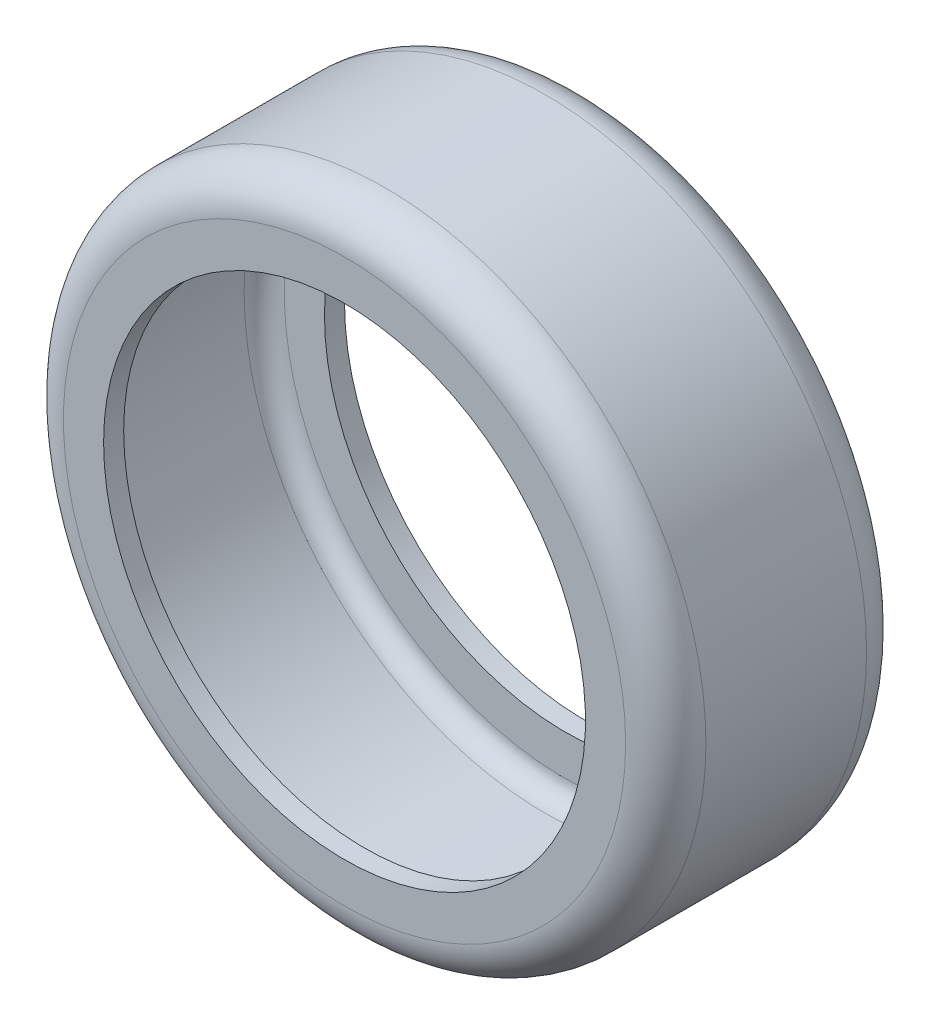
ISO-10303-21;
HEADER;
FILE_DESCRIPTION(('STEP AP214'),'2;1');
FILE_NAME('part.step','',(''),(''),'','','');
FILE_SCHEMA(('AUTOMOTIVE_DESIGN { 1 0 10303 214 1 1 1 1 }'));
ENDSEC;
DATA;
#1=APPLICATION_CONTEXT('core data for automotive mechanical design processes');
#2=APPLICATION_PROTOCOL_DEFINITION('international standard','automotive_design',2000,#1);
#3=PRODUCT_CONTEXT('',#1,'mechanical');
#4=PRODUCT('Part','Part','',(#3));
#5=PRODUCT_RELATED_PRODUCT_CATEGORY('part','',(#4));
#6=PRODUCT_DEFINITION_FORMATION('','',#4);
#7=PRODUCT_DEFINITION_CONTEXT('part definition',#1,'design');
#8=PRODUCT_DEFINITION('design','',#6,#7);
#9=PRODUCT_DEFINITION_SHAPE('','',#8);
#10=(LENGTH_UNIT() NAMED_UNIT(*) SI_UNIT(.MILLI.,.METRE.));
#11=(NAMED_UNIT(*) PLANE_ANGLE_UNIT() SI_UNIT($,.RADIAN.));
#12=(NAMED_UNIT(*) SI_UNIT($,.STERADIAN.) SOLID_ANGLE_UNIT());
#13=UNCERTAINTY_MEASURE_WITH_UNIT(LENGTH_MEASURE(1.E-05),#10,'distance_accuracy_value','');
#14=(GEOMETRIC_REPRESENTATION_CONTEXT(3) GLOBAL_UNCERTAINTY_ASSIGNED_CONTEXT((#13)) GLOBAL_UNIT_ASSIGNED_CONTEXT((#10,
#11,#12)) REPRESENTATION_CONTEXT('',''));
#15=CARTESIAN_POINT('',(0.,0.,0.));
#16=DIRECTION('',(0.,0.,1.));
#17=DIRECTION('',(1.,0.,0.));
#18=AXIS2_PLACEMENT_3D('',#15,#16,#17);
#19=CARTESIAN_POINT('',(0.,0.,38.1));
#20=DIRECTION('',(0.,0.,-1.));
#21=DIRECTION('',(-1.,0.,0.));
#22=AXIS2_PLACEMENT_3D('',#19,#20,#21);
#23=CYLINDRICAL_SURFACE('',#22,76.2);
#24=CARTESIAN_POINT('',(0.,0.,-38.1));
#25=DIRECTION('',(0.,0.,1.));
#26=DIRECTION('',(1.,0.,0.));
#27=AXIS2_PLACEMENT_3D('',#24,#25,#26);
#28=CIRCLE('',#27,76.2);
#29=CARTESIAN_POINT('',(-76.2,0.,-38.1));
#30=VERTEX_POINT('',#29);
#31=EDGE_CURVE('E68',#30,#30,#28,.T.);
#32=CARTESIAN_POINT('',(0.,0.,-31.75));
#33=DIRECTION('',(0.,0.,1.));
#34=DIRECTION('',(1.,0.,0.));
#35=AXIS2_PLACEMENT_3D('',#32,#33,#34);
#36=CIRCLE('',#35,76.2);
#37=CARTESIAN_POINT('',(-76.2,0.,-31.75));
#38=VERTEX_POINT('',#37);
#39=EDGE_CURVE('E76',#38,#38,#36,.T.);
#40=CARTESIAN_POINT('',(-76.2,0.,-38.1));
#41=CARTESIAN_POINT('',(-76.2,0.,-38.0338541666667));
#42=CARTESIAN_POINT('',(-76.2,0.,-37.9677083333333));
#43=CARTESIAN_POINT('',(-76.2,0.,-37.8354166666667));
#44=CARTESIAN_POINT('',(-76.2,0.,-37.7692708333333));
#45=CARTESIAN_POINT('',(-76.2,0.,-37.6369791666667));
#46=CARTESIAN_POINT('',(-76.2,0.,-37.5708333333333));
#47=CARTESIAN_POINT('',(-76.2,0.,-37.4385416666667));
#48=CARTESIAN_POINT('',(-76.2,0.,-37.3723958333333));
#49=CARTESIAN_POINT('',(-76.2,0.,-37.2401041666667));
#50=CARTESIAN_POINT('',(-76.2,0.,-37.1739583333333));
#51=CARTESIAN_POINT('',(-76.2,0.,-37.0416666666667));
#52=CARTESIAN_POINT('',(-76.2,0.,-36.9755208333333));
#53=CARTESIAN_POINT('',(-76.2,0.,-36.8432291666667));
#54=CARTESIAN_POINT('',(-76.2,0.,-36.7770833333333));
#55=CARTESIAN_POINT('',(-76.2,0.,-36.6447916666667));
#56=CARTESIAN_POINT('',(-76.2,0.,-36.5786458333333));
#57=CARTESIAN_POINT('',(-76.2,0.,-36.4463541666667));
#58=CARTESIAN_POINT('',(-76.2,0.,-36.3802083333333));
#59=CARTESIAN_POINT('',(-76.2,0.,-36.2479166666667));
#60=CARTESIAN_POINT('',(-76.2,0.,-36.1817708333333));
#61=CARTESIAN_POINT('',(-76.2,0.,-36.0494791666667));
#62=CARTESIAN_POINT('',(-76.2,0.,-35.9833333333333));
#63=CARTESIAN_POINT('',(-76.2,0.,-35.8510416666667));
#64=CARTESIAN_POINT('',(-76.2,0.,-35.7848958333333));
#65=CARTESIAN_POINT('',(-76.2,0.,-35.6526041666667));
#66=CARTESIAN_POINT('',(-76.2,0.,-35.5864583333333));
#67=CARTESIAN_POINT('',(-76.2,0.,-35.4541666666667));
#68=CARTESIAN_POINT('',(-76.2,0.,-35.3880208333333));
#69=CARTESIAN_POINT('',(-76.2,0.,-35.2557291666667));
#70=CARTESIAN_POINT('',(-76.2,0.,-35.1895833333333));
#71=CARTESIAN_POINT('',(-76.2,0.,-35.0572916666667));
#72=CARTESIAN_POINT('',(-76.2,0.,-34.9911458333333));
#73=CARTESIAN_POINT('',(-76.2,0.,-34.8588541666667));
#74=CARTESIAN_POINT('',(-76.2,0.,-34.7927083333333));
#75=CARTESIAN_POINT('',(-76.2,0.,-34.6604166666667));
#76=CARTESIAN_POINT('',(-76.2,0.,-34.5942708333333));
#77=CARTESIAN_POINT('',(-76.2,0.,-34.4619791666667));
#78=CARTESIAN_POINT('',(-76.2,0.,-34.3958333333333));
#79=CARTESIAN_POINT('',(-76.2,0.,-34.2635416666667));
#80=CARTESIAN_POINT('',(-76.2,0.,-34.1973958333333));
#81=CARTESIAN_POINT('',(-76.2,0.,-34.0651041666667));
#82=CARTESIAN_POINT('',(-76.2,0.,-33.9989583333333));
#83=CARTESIAN_POINT('',(-76.2,0.,-33.8666666666667));
#84=CARTESIAN_POINT('',(-76.2,0.,-33.8005208333333));
#85=CARTESIAN_POINT('',(-76.2,0.,-33.6682291666667));
#86=CARTESIAN_POINT('',(-76.2,0.,-33.6020833333333));
#87=CARTESIAN_POINT('',(-76.2,0.,-33.4697916666667));
#88=CARTESIAN_POINT('',(-76.2,0.,-33.4036458333333));
#89=CARTESIAN_POINT('',(-76.2,0.,-33.2713541666667));
#90=CARTESIAN_POINT('',(-76.2,0.,-33.2052083333333));
#91=CARTESIAN_POINT('',(-76.2,0.,-33.0729166666667));
#92=CARTESIAN_POINT('',(-76.2,0.,-33.0067708333333));
#93=CARTESIAN_POINT('',(-76.2,0.,-32.8744791666667));
#94=CARTESIAN_POINT('',(-76.2,0.,-32.8083333333333));
#95=CARTESIAN_POINT('',(-76.2,0.,-32.6760416666667));
#96=CARTESIAN_POINT('',(-76.2,0.,-32.6098958333333));
#97=CARTESIAN_POINT('',(-76.2,0.,-32.4776041666667));
#98=CARTESIAN_POINT('',(-76.2,0.,-32.4114583333333));
#99=CARTESIAN_POINT('',(-76.2,0.,-32.2791666666667));
#100=CARTESIAN_POINT('',(-76.2,0.,-32.2130208333333));
#101=CARTESIAN_POINT('',(-76.2,0.,-32.0807291666667));
#102=CARTESIAN_POINT('',(-76.2,0.,-32.0145833333333));
#103=CARTESIAN_POINT('',(-76.2,0.,-31.8822916666667));
#104=CARTESIAN_POINT('',(-76.2,0.,-31.8161458333333));
#105=CARTESIAN_POINT('',(-76.2,0.,-31.75));
#106=B_SPLINE_CURVE_WITH_KNOTS('',3,(#40,#41,#42,#43,#44,#45,#46,#47,#48,#49,#50,#51,#52,#53,
#54,#55,#56,#57,#58,#59,#60,#61,#62,#63,#64,#65,#66,#67,#68,#69,#70,#71,#72,#73,#74,#75,#76,#77,
#78,#79,#80,#81,#82,#83,#84,#85,#86,#87,#88,#89,#90,#91,#92,#93,#94,#95,#96,#97,#98,#99,#100,
#101,#102,#103,#104,#105),.UNSPECIFIED.,.F.,.F.,(4,2,2,2,2,2,2,2,2,2,2,2,2,2,2,2,2,2,2,2,2,2,2,
2,2,2,2,2,2,2,2,2,4),(0.,0.198437499999995,0.396875000000005,0.5953125,0.793749999999996,
0.992187500000005,1.190625,1.3890625,1.58749999999999,1.7859375,1.984375,2.18281249999999,
2.38125,2.5796875,2.77812499999999,2.9765625,3.175,3.37343749999999,3.571875,3.7703125,
3.96874999999999,4.1671875,4.365625,4.56406249999999,4.7625,4.9609375,5.15937499999999,
5.35781249999999,5.55625,5.75468749999999,5.95312499999999,6.1515625,6.34999999999999),.UNSPECIFIED.);
#107=EDGE_CURVE('BSEAM43',#30,#38,#106,.T.);
#108=ORIENTED_EDGE('',*,*,#31,.F.);
#109=ORIENTED_EDGE('',*,*,#39,.T.);
#110=ORIENTED_EDGE('',*,*,#107,.T.);
#111=ORIENTED_EDGE('',*,*,#107,.F.);
#112=EDGE_LOOP('',(#108,#110,#109,#111));
#113=FACE_BOUND('',#112,.T.);
#114=ADVANCED_FACE('F43',(#113),#23,.F.);
#115=CARTESIAN_POINT('',(0.,0.,38.1));
#116=DIRECTION('',(0.,0.,1.));
#117=DIRECTION('',(1.,0.,0.));
#118=AXIS2_PLACEMENT_3D('',#115,#116,#117);
#119=PLANE('',#118);
#120=CARTESIAN_POINT('',(0.,0.,38.1));
#121=DIRECTION('',(0.,0.,1.));
#122=DIRECTION('',(1.,0.,0.));
#123=AXIS2_PLACEMENT_3D('',#120,#121,#122);
#124=CIRCLE('',#123,88.9);
#125=CARTESIAN_POINT('',(88.9,0.,38.1));
#126=VERTEX_POINT('',#125);
#127=EDGE_CURVE('E10',#126,#126,#124,.T.);
#128=ORIENTED_EDGE('',*,*,#127,.T.);
#129=EDGE_LOOP('',(#128));
#130=FACE_BOUND('',#129,.T.);
#131=CARTESIAN_POINT('',(0.,0.,38.1));
#132=DIRECTION('',(0.,0.,1.));
#133=DIRECTION('',(1.,0.,0.));
#134=AXIS2_PLACEMENT_3D('',#131,#132,#133);
#135=CIRCLE('',#134,76.2);
#136=CARTESIAN_POINT('',(-76.2,0.,38.1));
#137=VERTEX_POINT('',#136);
#138=EDGE_CURVE('E67',#137,#137,#135,.T.);
#139=ORIENTED_EDGE('',*,*,#138,.F.);
#140=EDGE_LOOP('',(#139));
#141=FACE_BOUND('',#140,.T.);
#142=ADVANCED_FACE('F117',(#130,#141),#119,.T.);
#143=CARTESIAN_POINT('',(0.,0.,-38.1));
#144=DIRECTION('',(0.,0.,1.));
#145=DIRECTION('',(1.,0.,0.));
#146=AXIS2_PLACEMENT_3D('',#143,#144,#145);
#147=PLANE('',#146);
#148=CARTESIAN_POINT('',(0.,0.,-38.1));
#149=DIRECTION('',(0.,0.,1.));
#150=DIRECTION('',(1.,0.,0.));
#151=AXIS2_PLACEMENT_3D('',#148,#149,#150);
#152=CIRCLE('',#151,88.9);
#153=CARTESIAN_POINT('',(88.9,0.,-38.1));
#154=VERTEX_POINT('',#153);
#155=EDGE_CURVE('E51',#154,#154,#152,.F.);
#156=ORIENTED_EDGE('',*,*,#155,.T.);
#157=EDGE_LOOP('',(#156));
#158=FACE_BOUND('',#157,.T.);
#159=ORIENTED_EDGE('',*,*,#31,.T.);
#160=EDGE_LOOP('',(#159));
#161=FACE_BOUND('',#160,.T.);
#162=ADVANCED_FACE('F119',(#158,#161),#147,.F.);
#163=CARTESIAN_POINT('',(0.,0.,38.1));
#164=DIRECTION('',(0.,0.,-1.));
#165=DIRECTION('',(-1.,0.,0.));
#166=AXIS2_PLACEMENT_3D('',#163,#164,#165);
#167=CYLINDRICAL_SURFACE('',#166,101.6);
#168=CARTESIAN_POINT('',(0.,0.,-25.4));
#169=DIRECTION('',(0.,0.,1.));
#170=DIRECTION('',(1.,0.,0.));
#171=AXIS2_PLACEMENT_3D('',#168,#169,#170);
#172=CIRCLE('',#171,101.6);
#173=CARTESIAN_POINT('',(-101.6,0.,-25.4));
#174=VERTEX_POINT('',#173);
#175=EDGE_CURVE('E56',#174,#174,#172,.T.);
#176=CARTESIAN_POINT('',(0.,0.,25.4));
#177=DIRECTION('',(0.,0.,1.));
#178=DIRECTION('',(1.,0.,0.));
#179=AXIS2_PLACEMENT_3D('',#176,#177,#178);
#180=CIRCLE('',#179,101.6);
#181=CARTESIAN_POINT('',(-101.6,0.,25.4));
#182=VERTEX_POINT('',#181);
#183=EDGE_CURVE('E61',#182,#182,#180,.F.);
#184=CARTESIAN_POINT('',(-101.6,0.,-25.4));
#185=CARTESIAN_POINT('',(-101.6,0.,-24.8708333333333));
#186=CARTESIAN_POINT('',(-101.6,0.,-24.3416666666667));
#187=CARTESIAN_POINT('',(-101.6,0.,-23.2833333333334));
#188=CARTESIAN_POINT('',(-101.6,0.,-22.7541666666667));
#189=CARTESIAN_POINT('',(-101.6,0.,-21.6958333333333));
#190=CARTESIAN_POINT('',(-101.6,0.,-21.1666666666667));
#191=CARTESIAN_POINT('',(-101.6,0.,-20.1083333333333));
#192=CARTESIAN_POINT('',(-101.6,0.,-19.5791666666667));
#193=CARTESIAN_POINT('',(-101.6,0.,-18.5208333333333));
#194=CARTESIAN_POINT('',(-101.6,0.,-17.9916666666667));
#195=CARTESIAN_POINT('',(-101.6,0.,-16.9333333333334));
#196=CARTESIAN_POINT('',(-101.6,0.,-16.4041666666667));
#197=CARTESIAN_POINT('',(-101.6,0.,-15.3458333333333));
#198=CARTESIAN_POINT('',(-101.6,0.,-14.8166666666667));
#199=CARTESIAN_POINT('',(-101.6,0.,-13.7583333333334));
#200=CARTESIAN_POINT('',(-101.6,0.,-13.2291666666667));
#201=CARTESIAN_POINT('',(-101.6,0.,-12.1708333333333));
#202=CARTESIAN_POINT('',(-101.6,0.,-11.6416666666667));
#203=CARTESIAN_POINT('',(-101.6,0.,-10.5833333333333));
#204=CARTESIAN_POINT('',(-101.6,0.,-10.0541666666667));
#205=CARTESIAN_POINT('',(-101.6,0.,-8.99583333333335));
#206=CARTESIAN_POINT('',(-101.6,0.,-8.46666666666668));
#207=CARTESIAN_POINT('',(-101.6,0.,-7.40833333333335));
#208=CARTESIAN_POINT('',(-101.6,0.,-6.87916666666668));
#209=CARTESIAN_POINT('',(-101.6,0.,-5.82083333333334));
#210=CARTESIAN_POINT('',(-101.6,0.,-5.29166666666668));
#211=CARTESIAN_POINT('',(-101.6,0.,-4.23333333333334));
#212=CARTESIAN_POINT('',(-101.6,0.,-3.70416666666668));
#213=CARTESIAN_POINT('',(-101.6,0.,-2.64583333333334));
#214=CARTESIAN_POINT('',(-101.6,0.,-2.11666666666667));
#215=CARTESIAN_POINT('',(-101.6,0.,-1.05833333333334));
#216=CARTESIAN_POINT('',(-101.6,0.,-0.529166666666673));
#217=CARTESIAN_POINT('',(-101.6,0.,0.529166666666659));
#218=CARTESIAN_POINT('',(-101.6,0.,1.05833333333333));
#219=CARTESIAN_POINT('',(-101.6,0.,2.11666666666666));
#220=CARTESIAN_POINT('',(-101.6,0.,2.64583333333333));
#221=CARTESIAN_POINT('',(-101.6,0.,3.70416666666666));
#222=CARTESIAN_POINT('',(-101.6,0.,4.23333333333333));
#223=CARTESIAN_POINT('',(-101.6,0.,5.29166666666666));
#224=CARTESIAN_POINT('',(-101.6,0.,5.82083333333333));
#225=CARTESIAN_POINT('',(-101.6,0.,6.87916666666666));
#226=CARTESIAN_POINT('',(-101.6,0.,7.40833333333333));
#227=CARTESIAN_POINT('',(-101.6,0.,8.46666666666666));
#228=CARTESIAN_POINT('',(-101.6,0.,8.99583333333333));
#229=CARTESIAN_POINT('',(-101.6,0.,10.0541666666667));
#230=CARTESIAN_POINT('',(-101.6,0.,10.5833333333333));
#231=CARTESIAN_POINT('',(-101.6,0.,11.6416666666667));
#232=CARTESIAN_POINT('',(-101.6,0.,12.1708333333333));
#233=CARTESIAN_POINT('',(-101.6,0.,13.2291666666667));
#234=CARTESIAN_POINT('',(-101.6,0.,13.7583333333333));
#235=CARTESIAN_POINT('',(-101.6,0.,14.8166666666667));
#236=CARTESIAN_POINT('',(-101.6,0.,15.3458333333333));
#237=CARTESIAN_POINT('',(-101.6,0.,16.4041666666667));
#238=CARTESIAN_POINT('',(-101.6,0.,16.9333333333333));
#239=CARTESIAN_POINT('',(-101.6,0.,17.9916666666667));
#240=CARTESIAN_POINT('',(-101.6,0.,18.5208333333333));
#241=CARTESIAN_POINT('',(-101.6,0.,19.5791666666667));
#242=CARTESIAN_POINT('',(-101.6,0.,20.1083333333333));
#243=CARTESIAN_POINT('',(-101.6,0.,21.1666666666667));
#244=CARTESIAN_POINT('',(-101.6,0.,21.6958333333333));
#245=CARTESIAN_POINT('',(-101.6,0.,22.7541666666667));
#246=CARTESIAN_POINT('',(-101.6,0.,23.2833333333333));
#247=CARTESIAN_POINT('',(-101.6,0.,24.3416666666667));
#248=CARTESIAN_POINT('',(-101.6,0.,24.8708333333333));
#249=CARTESIAN_POINT('',(-101.6,0.,25.4));
#250=B_SPLINE_CURVE_WITH_KNOTS('',3,(#184,#185,#186,#187,#188,#189,#190,#191,#192,#193,#194,
#195,#196,#197,#198,#199,#200,#201,#202,#203,#204,#205,#206,#207,#208,#209,#210,#211,#212,#213,
#214,#215,#216,#217,#218,#219,#220,#221,#222,#223,#224,#225,#226,#227,#228,#229,#230,#231,#232,
#233,#234,#235,#236,#237,#238,#239,#240,#241,#242,#243,#244,#245,#246,#247,#248,#249),
.UNSPECIFIED.,.F.,.F.,(4,2,2,2,2,2,2,2,2,2,2,2,2,2,2,2,2,2,2,2,2,2,2,2,2,2,2,2,2,2,2,2,4),(0.,
1.58749999999999,3.175,4.7625,6.34999999999999,7.93749999999999,9.525,11.1125,12.7,14.2875,
15.875,17.4625,19.05,20.6375,22.225,23.8125,25.4,26.9875,28.575,30.1625,31.75,33.3375,34.925,
36.5125,38.1,39.6875,41.275,42.8625,44.45,46.0375,47.625,49.2125,50.8),.UNSPECIFIED.);
#251=EDGE_CURVE('BSEAM113',#174,#182,#250,.T.);
#252=ORIENTED_EDGE('',*,*,#175,.T.);
#253=ORIENTED_EDGE('',*,*,#183,.T.);
#254=ORIENTED_EDGE('',*,*,#251,.T.);
#255=ORIENTED_EDGE('',*,*,#251,.F.);
#256=EDGE_LOOP('',(#252,#254,#253,#255));
#257=FACE_BOUND('',#256,.T.);
#258=ADVANCED_FACE('F113',(#257),#167,.T.);
#259=CARTESIAN_POINT('',(0.,0.,31.75));
#260=DIRECTION('',(0.,0.,1.));
#261=DIRECTION('',(1.,0.,0.));
#262=AXIS2_PLACEMENT_3D('',#259,#260,#261);
#263=CIRCLE('',#262,76.2);
#264=CARTESIAN_POINT('',(-76.2,0.,31.75));
#265=VERTEX_POINT('',#264);
#266=EDGE_CURVE('E80',#265,#265,#263,.T.);
#267=CARTESIAN_POINT('',(-76.2,0.,31.75));
#268=CARTESIAN_POINT('',(-76.2,0.,31.8161458333333));
#269=CARTESIAN_POINT('',(-76.2,0.,31.8822916666667));
#270=CARTESIAN_POINT('',(-76.2,0.,32.0145833333333));
#271=CARTESIAN_POINT('',(-76.2,0.,32.0807291666667));
#272=CARTESIAN_POINT('',(-76.2,0.,32.2130208333333));
#273=CARTESIAN_POINT('',(-76.2,0.,32.2791666666667));
#274=CARTESIAN_POINT('',(-76.2,0.,32.4114583333333));
#275=CARTESIAN_POINT('',(-76.2,0.,32.4776041666667));
#276=CARTESIAN_POINT('',(-76.2,0.,32.6098958333333));
#277=CARTESIAN_POINT('',(-76.2,0.,32.6760416666667));
#278=CARTESIAN_POINT('',(-76.2,0.,32.8083333333333));
#279=CARTESIAN_POINT('',(-76.2,0.,32.8744791666667));
#280=CARTESIAN_POINT('',(-76.2,0.,33.0067708333333));
#281=CARTESIAN_POINT('',(-76.2,0.,33.0729166666667));
#282=CARTESIAN_POINT('',(-76.2,0.,33.2052083333333));
#283=CARTESIAN_POINT('',(-76.2,0.,33.2713541666667));
#284=CARTESIAN_POINT('',(-76.2,0.,33.4036458333333));
#285=CARTESIAN_POINT('',(-76.2,0.,33.4697916666667));
#286=CARTESIAN_POINT('',(-76.2,0.,33.6020833333333));
#287=CARTESIAN_POINT('',(-76.2,0.,33.6682291666667));
#288=CARTESIAN_POINT('',(-76.2,0.,33.8005208333333));
#289=CARTESIAN_POINT('',(-76.2,0.,33.8666666666667));
#290=CARTESIAN_POINT('',(-76.2,0.,33.9989583333333));
#291=CARTESIAN_POINT('',(-76.2,0.,34.0651041666667));
#292=CARTESIAN_POINT('',(-76.2,0.,34.1973958333333));
#293=CARTESIAN_POINT('',(-76.2,0.,34.2635416666667));
#294=CARTESIAN_POINT('',(-76.2,0.,34.3958333333333));
#295=CARTESIAN_POINT('',(-76.2,0.,34.4619791666667));
#296=CARTESIAN_POINT('',(-76.2,0.,34.5942708333333));
#297=CARTESIAN_POINT('',(-76.2,0.,34.6604166666667));
#298=CARTESIAN_POINT('',(-76.2,0.,34.7927083333333));
#299=CARTESIAN_POINT('',(-76.2,0.,34.8588541666667));
#300=CARTESIAN_POINT('',(-76.2,0.,34.9911458333333));
#301=CARTESIAN_POINT('',(-76.2,0.,35.0572916666667));
#302=CARTESIAN_POINT('',(-76.2,0.,35.1895833333333));
#303=CARTESIAN_POINT('',(-76.2,0.,35.2557291666667));
#304=CARTESIAN_POINT('',(-76.2,0.,35.3880208333333));
#305=CARTESIAN_POINT('',(-76.2,0.,35.4541666666667));
#306=CARTESIAN_POINT('',(-76.2,0.,35.5864583333333));
#307=CARTESIAN_POINT('',(-76.2,0.,35.6526041666667));
#308=CARTESIAN_POINT('',(-76.2,0.,35.7848958333333));
#309=CARTESIAN_POINT('',(-76.2,0.,35.8510416666667));
#310=CARTESIAN_POINT('',(-76.2,0.,35.9833333333333));
#311=CARTESIAN_POINT('',(-76.2,0.,36.0494791666667));
#312=CARTESIAN_POINT('',(-76.2,0.,36.1817708333333));
#313=CARTESIAN_POINT('',(-76.2,0.,36.2479166666667));
#314=CARTESIAN_POINT('',(-76.2,0.,36.3802083333333));
#315=CARTESIAN_POINT('',(-76.2,0.,36.4463541666667));
#316=CARTESIAN_POINT('',(-76.2,0.,36.5786458333333));
#317=CARTESIAN_POINT('',(-76.2,0.,36.6447916666667));
#318=CARTESIAN_POINT('',(-76.2,0.,36.7770833333333));
#319=CARTESIAN_POINT('',(-76.2,0.,36.8432291666667));
#320=CARTESIAN_POINT('',(-76.2,0.,36.9755208333333));
#321=CARTESIAN_POINT('',(-76.2,0.,37.0416666666667));
#322=CARTESIAN_POINT('',(-76.2,0.,37.1739583333333));
#323=CARTESIAN_POINT('',(-76.2,0.,37.2401041666667));
#324=CARTESIAN_POINT('',(-76.2,0.,37.3723958333333));
#325=CARTESIAN_POINT('',(-76.2,0.,37.4385416666667));
#326=CARTESIAN_POINT('',(-76.2,0.,37.5708333333333));
#327=CARTESIAN_POINT('',(-76.2,0.,37.6369791666667));
#328=CARTESIAN_POINT('',(-76.2,0.,37.7692708333333));
#329=CARTESIAN_POINT('',(-76.2,0.,37.8354166666667));
#330=CARTESIAN_POINT('',(-76.2,0.,37.9677083333333));
#331=CARTESIAN_POINT('',(-76.2,0.,38.0338541666667));
#332=CARTESIAN_POINT('',(-76.2,0.,38.1));
#333=B_SPLINE_CURVE_WITH_KNOTS('',3,(#267,#268,#269,#270,#271,#272,#273,#274,#275,#276,#277,
#278,#279,#280,#281,#282,#283,#284,#285,#286,#287,#288,#289,#290,#291,#292,#293,#294,#295,#296,
#297,#298,#299,#300,#301,#302,#303,#304,#305,#306,#307,#308,#309,#310,#311,#312,#313,#314,#315,
#316,#317,#318,#319,#320,#321,#322,#323,#324,#325,#326,#327,#328,#329,#330,#331,#332),
.UNSPECIFIED.,.F.,.F.,(4,2,2,2,2,2,2,2,2,2,2,2,2,2,2,2,2,2,2,2,2,2,2,2,2,2,2,2,2,2,2,2,4),(0.,
0.198437500000002,0.396875000000005,0.5953125,0.793750000000003,0.992187500000005,1.190625,
1.3890625,1.58750000000001,1.7859375,1.984375,2.18281250000001,2.38125,2.5796875,
2.77812500000001,2.9765625,3.175,3.37343750000001,3.571875,3.7703125,3.96875000000001,4.1671875,
4.365625,4.56406250000001,4.7625,4.96093750000001,5.15937500000001,5.3578125,5.55625000000001,
5.75468750000001,5.953125,6.15156250000001,6.35000000000001),.UNSPECIFIED.);
#334=EDGE_CURVE('BSEAM109',#265,#137,#333,.T.);
#335=ORIENTED_EDGE('',*,*,#266,.F.);
#336=ORIENTED_EDGE('',*,*,#138,.T.);
#337=ORIENTED_EDGE('',*,*,#334,.T.);
#338=ORIENTED_EDGE('',*,*,#334,.F.);
#339=EDGE_LOOP('',(#335,#337,#336,#338));
#340=FACE_BOUND('',#339,.T.);
#341=ADVANCED_FACE('F109',(#340),#23,.F.);
#342=CARTESIAN_POINT('',(0.,0.,-25.4));
#343=DIRECTION('',(0.,0.,1.));
#344=DIRECTION('',(1.,0.,0.));
#345=AXIS2_PLACEMENT_3D('',#342,#343,#344);
#346=TOROIDAL_SURFACE('',#345,88.9,12.7);
#347=ORIENTED_EDGE('',*,*,#155,.F.);
#348=EDGE_LOOP('',(#347));
#349=FACE_BOUND('',#348,.T.);
#350=ORIENTED_EDGE('',*,*,#175,.F.);
#351=EDGE_LOOP('',(#350));
#352=FACE_BOUND('',#351,.T.);
#353=ADVANCED_FACE('F112',(#349,#352),#346,.T.);
#354=CARTESIAN_POINT('',(0.,0.,25.4));
#355=DIRECTION('',(0.,0.,1.));
#356=DIRECTION('',(1.,0.,0.));
#357=AXIS2_PLACEMENT_3D('',#354,#355,#356);
#358=TOROIDAL_SURFACE('',#357,88.9,12.7);
#359=ORIENTED_EDGE('',*,*,#183,.F.);
#360=EDGE_LOOP('',(#359));
#361=FACE_BOUND('',#360,.T.);
#362=ORIENTED_EDGE('',*,*,#127,.F.);
#363=EDGE_LOOP('',(#362));
#364=FACE_BOUND('',#363,.T.);
#365=ADVANCED_FACE('F45',(#361,#364),#358,.T.);
#366=CARTESIAN_POINT('',(0.,0.,31.75));
#367=DIRECTION('',(0.,0.,1.));
#368=DIRECTION('',(1.,0.,0.));
#369=AXIS2_PLACEMENT_3D('',#366,#367,#368);
#370=PLANE('',#369);
#371=CARTESIAN_POINT('',(0.,0.,31.75));
#372=DIRECTION('',(0.,0.,1.));
#373=DIRECTION('',(1.,0.,0.));
#374=AXIS2_PLACEMENT_3D('',#371,#372,#373);
#375=CIRCLE('',#374,88.9);
#376=CARTESIAN_POINT('',(88.9,0.,31.75));
#377=VERTEX_POINT('',#376);
#378=EDGE_CURVE('E72',#377,#377,#375,.T.);
#379=ORIENTED_EDGE('',*,*,#378,.F.);
#380=EDGE_LOOP('',(#379));
#381=FACE_BOUND('',#380,.T.);
#382=ORIENTED_EDGE('',*,*,#266,.T.);
#383=EDGE_LOOP('',(#382));
#384=FACE_BOUND('',#383,.T.);
#385=ADVANCED_FACE('F102',(#381,#384),#370,.F.);
#386=CARTESIAN_POINT('',(0.,0.,-31.75));
#387=DIRECTION('',(0.,0.,1.));
#388=DIRECTION('',(1.,0.,0.));
#389=AXIS2_PLACEMENT_3D('',#386,#387,#388);
#390=PLANE('',#389);
#391=CARTESIAN_POINT('',(0.,0.,-31.75));
#392=DIRECTION('',(0.,0.,1.));
#393=DIRECTION('',(1.,0.,0.));
#394=AXIS2_PLACEMENT_3D('',#391,#392,#393);
#395=CIRCLE('',#394,88.9);
#396=CARTESIAN_POINT('',(88.9,0.,-31.75));
#397=VERTEX_POINT('',#396);
#398=EDGE_CURVE('E85',#397,#397,#395,.F.);
#399=ORIENTED_EDGE('',*,*,#398,.F.);
#400=EDGE_LOOP('',(#399));
#401=FACE_BOUND('',#400,.T.);
#402=ORIENTED_EDGE('',*,*,#39,.F.);
#403=EDGE_LOOP('',(#402));
#404=FACE_BOUND('',#403,.T.);
#405=ADVANCED_FACE('F105',(#401,#404),#390,.T.);
#406=CARTESIAN_POINT('',(0.,0.,38.1));
#407=DIRECTION('',(0.,0.,-1.));
#408=DIRECTION('',(-1.,0.,0.));
#409=AXIS2_PLACEMENT_3D('',#406,#407,#408);
#410=CYLINDRICAL_SURFACE('',#409,95.25);
#411=CARTESIAN_POINT('',(0.,0.,-25.4));
#412=DIRECTION('',(0.,0.,-1.));
#413=DIRECTION('',(-1.,0.,0.));
#414=AXIS2_PLACEMENT_3D('',#411,#412,#413);
#415=CIRCLE('',#414,95.25);
#416=CARTESIAN_POINT('',(-95.25,0.,-25.4));
#417=VERTEX_POINT('',#416);
#418=EDGE_CURVE('E89',#417,#417,#415,.F.);
#419=CARTESIAN_POINT('',(0.,0.,25.4));
#420=DIRECTION('',(0.,0.,-1.));
#421=DIRECTION('',(-1.,0.,0.));
#422=AXIS2_PLACEMENT_3D('',#419,#420,#421);
#423=CIRCLE('',#422,95.25);
#424=CARTESIAN_POINT('',(-95.25,0.,25.4));
#425=VERTEX_POINT('',#424);
#426=EDGE_CURVE('E84',#425,#425,#423,.T.);
#427=CARTESIAN_POINT('',(-95.25,0.,-25.4));
#428=CARTESIAN_POINT('',(-95.25,0.,-24.8708333333333));
#429=CARTESIAN_POINT('',(-95.25,0.,-24.3416666666666));
#430=CARTESIAN_POINT('',(-95.25,0.,-23.2833333333333));
#431=CARTESIAN_POINT('',(-95.25,0.,-22.7541666666666));
#432=CARTESIAN_POINT('',(-95.25,0.,-21.6958333333333));
#433=CARTESIAN_POINT('',(-95.25,0.,-21.1666666666666));
#434=CARTESIAN_POINT('',(-95.25,0.,-20.1083333333333));
#435=CARTESIAN_POINT('',(-95.25,0.,-19.5791666666666));
#436=CARTESIAN_POINT('',(-95.25,0.,-18.5208333333333));
#437=CARTESIAN_POINT('',(-95.25,0.,-17.9916666666666));
#438=CARTESIAN_POINT('',(-95.25,0.,-16.9333333333333));
#439=CARTESIAN_POINT('',(-95.25,0.,-16.4041666666666));
#440=CARTESIAN_POINT('',(-95.25,0.,-15.3458333333333));
#441=CARTESIAN_POINT('',(-95.25,0.,-14.8166666666666));
#442=CARTESIAN_POINT('',(-95.25,0.,-13.7583333333333));
#443=CARTESIAN_POINT('',(-95.25,0.,-13.2291666666666));
#444=CARTESIAN_POINT('',(-95.25,0.,-12.1708333333333));
#445=CARTESIAN_POINT('',(-95.25,0.,-11.6416666666666));
#446=CARTESIAN_POINT('',(-95.25,0.,-10.5833333333333));
#447=CARTESIAN_POINT('',(-95.25,0.,-10.0541666666666));
#448=CARTESIAN_POINT('',(-95.25,0.,-8.99583333333331));
#449=CARTESIAN_POINT('',(-95.25,0.,-8.46666666666664));
#450=CARTESIAN_POINT('',(-95.25,0.,-7.40833333333331));
#451=CARTESIAN_POINT('',(-95.25,0.,-6.87916666666664));
#452=CARTESIAN_POINT('',(-95.25,0.,-5.82083333333331));
#453=CARTESIAN_POINT('',(-95.25,0.,-5.29166666666664));
#454=CARTESIAN_POINT('',(-95.25,0.,-4.23333333333331));
#455=CARTESIAN_POINT('',(-95.25,0.,-3.70416666666664));
#456=CARTESIAN_POINT('',(-95.25,0.,-2.64583333333331));
#457=CARTESIAN_POINT('',(-95.25,0.,-2.11666666666664));
#458=CARTESIAN_POINT('',(-95.25,0.,-1.05833333333331));
#459=CARTESIAN_POINT('',(-95.25,0.,-0.529166666666641));
#460=CARTESIAN_POINT('',(-95.25,0.,0.529166666666692));
#461=CARTESIAN_POINT('',(-95.25,0.,1.05833333333336));
#462=CARTESIAN_POINT('',(-95.25,0.,2.11666666666669));
#463=CARTESIAN_POINT('',(-95.25,0.,2.64583333333336));
#464=CARTESIAN_POINT('',(-95.25,0.,3.70416666666669));
#465=CARTESIAN_POINT('',(-95.25,0.,4.23333333333336));
#466=CARTESIAN_POINT('',(-95.25,0.,5.29166666666669));
#467=CARTESIAN_POINT('',(-95.25,0.,5.82083333333336));
#468=CARTESIAN_POINT('',(-95.25,0.,6.87916666666669));
#469=CARTESIAN_POINT('',(-95.25,0.,7.40833333333335));
#470=CARTESIAN_POINT('',(-95.25,0.,8.46666666666668));
#471=CARTESIAN_POINT('',(-95.25,0.,8.99583333333335));
#472=CARTESIAN_POINT('',(-95.25,0.,10.0541666666667));
#473=CARTESIAN_POINT('',(-95.25,0.,10.5833333333333));
#474=CARTESIAN_POINT('',(-95.25,0.,11.6416666666667));
#475=CARTESIAN_POINT('',(-95.25,0.,12.1708333333333));
#476=CARTESIAN_POINT('',(-95.25,0.,13.2291666666667));
#477=CARTESIAN_POINT('',(-95.25,0.,13.7583333333333));
#478=CARTESIAN_POINT('',(-95.25,0.,14.8166666666667));
#479=CARTESIAN_POINT('',(-95.25,0.,15.3458333333333));
#480=CARTESIAN_POINT('',(-95.25,0.,16.4041666666667));
#481=CARTESIAN_POINT('',(-95.25,0.,16.9333333333333));
#482=CARTESIAN_POINT('',(-95.25,0.,17.9916666666667));
#483=CARTESIAN_POINT('',(-95.25,0.,18.5208333333333));
#484=CARTESIAN_POINT('',(-95.25,0.,19.5791666666667));
#485=CARTESIAN_POINT('',(-95.25,0.,20.1083333333333));
#486=CARTESIAN_POINT('',(-95.25,0.,21.1666666666667));
#487=CARTESIAN_POINT('',(-95.25,0.,21.6958333333333));
#488=CARTESIAN_POINT('',(-95.25,0.,22.7541666666667));
#489=CARTESIAN_POINT('',(-95.25,0.,23.2833333333333));
#490=CARTESIAN_POINT('',(-95.25,0.,24.3416666666667));
#491=CARTESIAN_POINT('',(-95.25,0.,24.8708333333333));
#492=CARTESIAN_POINT('',(-95.25,0.,25.4));
#493=B_SPLINE_CURVE_WITH_KNOTS('',3,(#427,#428,#429,#430,#431,#432,#433,#434,#435,#436,#437,
#438,#439,#440,#441,#442,#443,#444,#445,#446,#447,#448,#449,#450,#451,#452,#453,#454,#455,#456,
#457,#458,#459,#460,#461,#462,#463,#464,#465,#466,#467,#468,#469,#470,#471,#472,#473,#474,#475,
#476,#477,#478,#479,#480,#481,#482,#483,#484,#485,#486,#487,#488,#489,#490,#491,#492),
.UNSPECIFIED.,.F.,.F.,(4,2,2,2,2,2,2,2,2,2,2,2,2,2,2,2,2,2,2,2,2,2,2,2,2,2,2,2,2,2,2,2,4),(0.,
1.58749999999999,3.17499999999999,4.76249999999999,6.34999999999999,7.93749999999999,
9.52499999999998,11.1125,12.7,14.2875,15.875,17.4625,19.05,20.6375,22.225,23.8125,25.4,26.9875,
28.575,30.1625,31.75,33.3375,34.925,36.5125,38.1,39.6875,41.275,42.8625,44.45,46.0375,47.625,
49.2125,50.8),.UNSPECIFIED.);
#494=EDGE_CURVE('BSEAM166',#417,#425,#493,.T.);
#495=ORIENTED_EDGE('',*,*,#418,.F.);
#496=ORIENTED_EDGE('',*,*,#426,.F.);
#497=ORIENTED_EDGE('',*,*,#494,.T.);
#498=ORIENTED_EDGE('',*,*,#494,.F.);
#499=EDGE_LOOP('',(#495,#497,#496,#498));
#500=FACE_BOUND('',#499,.T.);
#501=ADVANCED_FACE('F166',(#500),#410,.F.);
#502=CARTESIAN_POINT('',(0.,0.,-25.4));
#503=DIRECTION('',(0.,0.,1.));
#504=DIRECTION('',(1.,0.,0.));
#505=AXIS2_PLACEMENT_3D('',#502,#503,#504);
#506=TOROIDAL_SURFACE('',#505,88.9,6.35);
#507=ORIENTED_EDGE('',*,*,#398,.T.);
#508=EDGE_LOOP('',(#507));
#509=FACE_BOUND('',#508,.T.);
#510=ORIENTED_EDGE('',*,*,#418,.T.);
#511=EDGE_LOOP('',(#510));
#512=FACE_BOUND('',#511,.T.);
#513=ADVANCED_FACE('F175',(#509,#512),#506,.F.);
#514=CARTESIAN_POINT('',(0.,0.,25.4));
#515=DIRECTION('',(0.,0.,1.));
#516=DIRECTION('',(1.,0.,0.));
#517=AXIS2_PLACEMENT_3D('',#514,#515,#516);
#518=TOROIDAL_SURFACE('',#517,88.9,6.35);
#519=ORIENTED_EDGE('',*,*,#426,.T.);
#520=EDGE_LOOP('',(#519));
#521=FACE_BOUND('',#520,.T.);
#522=ORIENTED_EDGE('',*,*,#378,.T.);
#523=EDGE_LOOP('',(#522));
#524=FACE_BOUND('',#523,.T.);
#525=ADVANCED_FACE('F100',(#521,#524),#518,.F.);
#526=CLOSED_SHELL('',(#114,#142,#162,#258,#341,#353,#365,#385,#405,#501,#513,#525));
#527=MANIFOLD_SOLID_BREP('B2',#526);
#528=ADVANCED_BREP_SHAPE_REPRESENTATION('',(#18,#527),#14);
#529=SHAPE_DEFINITION_REPRESENTATION(#9,#528);
ENDSEC;
END-ISO-10303-21;
